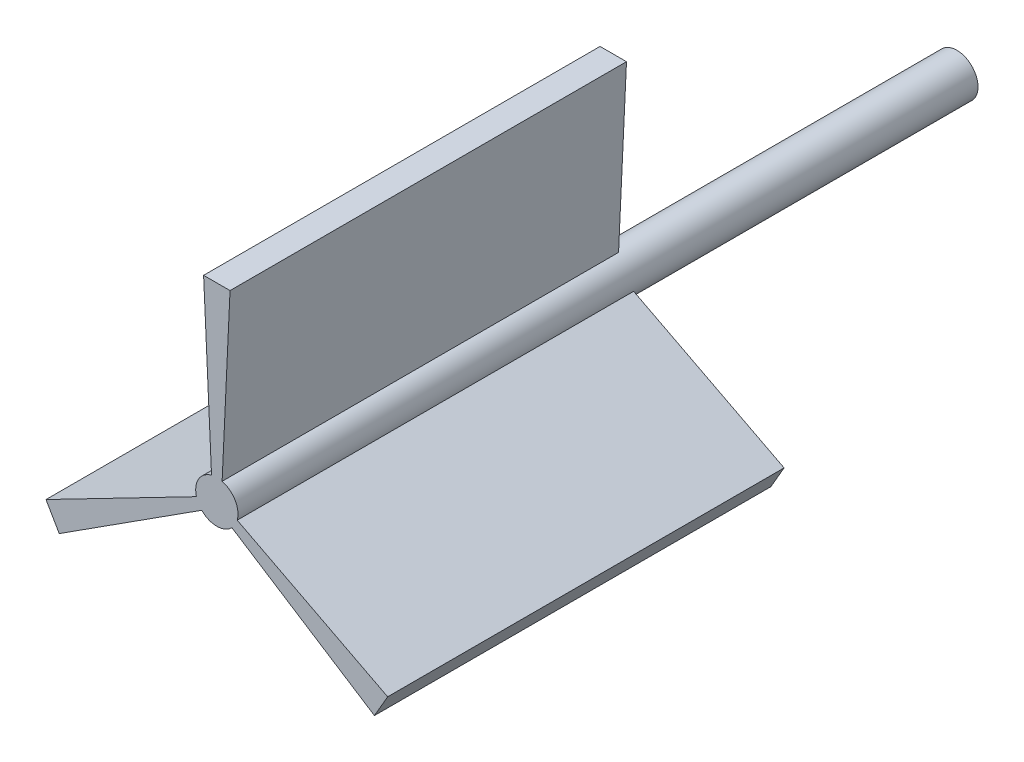
ISO-10303-21;
HEADER;
FILE_DESCRIPTION(('STEP AP214'),'2;1');
FILE_NAME('part.step','',(''),(''),'','','');
FILE_SCHEMA(('AUTOMOTIVE_DESIGN { 1 0 10303 214 1 1 1 1 }'));
ENDSEC;
DATA;
#1=APPLICATION_CONTEXT('core data for automotive mechanical design processes');
#2=APPLICATION_PROTOCOL_DEFINITION('international standard','automotive_design',2000,#1);
#3=PRODUCT_CONTEXT('',#1,'mechanical');
#4=PRODUCT('Part','Part','',(#3));
#5=PRODUCT_RELATED_PRODUCT_CATEGORY('part','',(#4));
#6=PRODUCT_DEFINITION_FORMATION('','',#4);
#7=PRODUCT_DEFINITION_CONTEXT('part definition',#1,'design');
#8=PRODUCT_DEFINITION('design','',#6,#7);
#9=PRODUCT_DEFINITION_SHAPE('','',#8);
#10=(LENGTH_UNIT() NAMED_UNIT(*) SI_UNIT(.MILLI.,.METRE.));
#11=(NAMED_UNIT(*) PLANE_ANGLE_UNIT() SI_UNIT($,.RADIAN.));
#12=(NAMED_UNIT(*) SI_UNIT($,.STERADIAN.) SOLID_ANGLE_UNIT());
#13=UNCERTAINTY_MEASURE_WITH_UNIT(LENGTH_MEASURE(1.E-05),#10,'distance_accuracy_value','');
#14=(GEOMETRIC_REPRESENTATION_CONTEXT(3) GLOBAL_UNCERTAINTY_ASSIGNED_CONTEXT((#13)) GLOBAL_UNIT_ASSIGNED_CONTEXT((#10,
#11,#12)) REPRESENTATION_CONTEXT('',''));
#15=CARTESIAN_POINT('',(0.,0.,0.));
#16=DIRECTION('',(0.,0.,1.));
#17=DIRECTION('',(1.,0.,0.));
#18=AXIS2_PLACEMENT_3D('',#15,#16,#17);
#19=CARTESIAN_POINT('',(0.,0.,140.));
#20=DIRECTION('',(0.,0.,-1.));
#21=DIRECTION('',(-1.,0.,0.));
#22=AXIS2_PLACEMENT_3D('',#19,#20,#21);
#23=CYLINDRICAL_SURFACE('',#22,4.);
#24=CARTESIAN_POINT('',(0.,0.,65.));
#25=DIRECTION('',(0.,0.,1.));
#26=DIRECTION('',(1.,0.,0.));
#27=AXIS2_PLACEMENT_3D('',#24,#25,#26);
#28=CIRCLE('',#27,4.);
#29=CARTESIAN_POINT('',(-3.85410196624968,-1.07046626931927,65.));
#30=VERTEX_POINT('',#29);
#31=CARTESIAN_POINT('',(-2.85410196624968,-2.80251707688815,65.));
#32=VERTEX_POINT('',#31);
#33=EDGE_CURVE('E11',#30,#32,#28,.T.);
#34=ORIENTED_EDGE('',*,*,#33,.F.);
#35=DIRECTION('',(0.,0.,1.));
#36=VECTOR('',#35,1.);
#37=CARTESIAN_POINT('',(-3.85410196624968,-1.07046626931927,65.));
#38=LINE('',#37,#36);
#39=CARTESIAN_POINT('',(-3.85410196624968,-1.07046626931927,140.));
#40=VERTEX_POINT('',#39);
#41=EDGE_CURVE('E152',#30,#40,#38,.T.);
#42=ORIENTED_EDGE('',*,*,#41,.T.);
#43=CARTESIAN_POINT('',(0.,0.,140.));
#44=DIRECTION('',(0.,0.,1.));
#45=DIRECTION('',(1.,0.,0.));
#46=AXIS2_PLACEMENT_3D('',#43,#44,#45);
#47=CIRCLE('',#46,4.);
#48=CARTESIAN_POINT('',(-1.,3.87298334620742,140.));
#49=VERTEX_POINT('',#48);
#50=EDGE_CURVE('E207',#49,#40,#47,.T.);
#51=ORIENTED_EDGE('',*,*,#50,.F.);
#52=DIRECTION('',(0.,0.,1.));
#53=VECTOR('',#52,1.);
#54=CARTESIAN_POINT('',(-1.,3.87298334620742,65.));
#55=LINE('',#54,#53);
#56=CARTESIAN_POINT('',(-1.,3.87298334620742,65.));
#57=VERTEX_POINT('',#56);
#58=EDGE_CURVE('E201',#57,#49,#55,.T.);
#59=ORIENTED_EDGE('',*,*,#58,.F.);
#60=CARTESIAN_POINT('',(0.,0.,65.));
#61=DIRECTION('',(0.,0.,-1.));
#62=DIRECTION('',(-1.,0.,0.));
#63=AXIS2_PLACEMENT_3D('',#60,#61,#62);
#64=CIRCLE('',#63,4.);
#65=CARTESIAN_POINT('',(1.,3.87298334620742,65.));
#66=VERTEX_POINT('',#65);
#67=EDGE_CURVE('E210',#57,#66,#64,.T.);
#68=ORIENTED_EDGE('',*,*,#67,.T.);
#69=DIRECTION('',(0.,0.,1.));
#70=VECTOR('',#69,1.);
#71=CARTESIAN_POINT('',(1.,3.87298334620742,65.));
#72=LINE('',#71,#70);
#73=CARTESIAN_POINT('',(1.,3.87298334620742,140.));
#74=VERTEX_POINT('',#73);
#75=EDGE_CURVE('E197',#66,#74,#72,.T.);
#76=ORIENTED_EDGE('',*,*,#75,.T.);
#77=CARTESIAN_POINT('',(3.85410196624969,-1.07046626931927,140.));
#78=VERTEX_POINT('',#77);
#79=EDGE_CURVE('E212',#78,#74,#47,.T.);
#80=ORIENTED_EDGE('',*,*,#79,.F.);
#81=DIRECTION('',(0.,0.,1.));
#82=VECTOR('',#81,1.);
#83=CARTESIAN_POINT('',(3.85410196624968,-1.07046626931927,65.));
#84=LINE('',#83,#82);
#85=CARTESIAN_POINT('',(3.85410196624968,-1.07046626931927,65.));
#86=VERTEX_POINT('',#85);
#87=EDGE_CURVE('E177',#86,#78,#84,.T.);
#88=ORIENTED_EDGE('',*,*,#87,.F.);
#89=CARTESIAN_POINT('',(0.,0.,65.));
#90=DIRECTION('',(0.,0.,1.));
#91=DIRECTION('',(1.,0.,0.));
#92=AXIS2_PLACEMENT_3D('',#89,#90,#91);
#93=CIRCLE('',#92,4.);
#94=CARTESIAN_POINT('',(2.85410196624969,-2.80251707688815,65.));
#95=VERTEX_POINT('',#94);
#96=EDGE_CURVE('E40',#95,#86,#93,.T.);
#97=ORIENTED_EDGE('',*,*,#96,.F.);
#98=DIRECTION('',(0.,0.,1.));
#99=VECTOR('',#98,1.);
#100=CARTESIAN_POINT('',(2.85410196624969,-2.80251707688815,65.));
#101=LINE('',#100,#99);
#102=CARTESIAN_POINT('',(2.85410196624969,-2.80251707688815,140.));
#103=VERTEX_POINT('',#102);
#104=EDGE_CURVE('E174',#95,#103,#101,.T.);
#105=ORIENTED_EDGE('',*,*,#104,.T.);
#106=CARTESIAN_POINT('',(-2.85410196624968,-2.80251707688815,140.));
#107=VERTEX_POINT('',#106);
#108=EDGE_CURVE('E211',#107,#103,#47,.T.);
#109=ORIENTED_EDGE('',*,*,#108,.F.);
#110=DIRECTION('',(0.,0.,1.));
#111=VECTOR('',#110,1.);
#112=CARTESIAN_POINT('',(-2.85410196624968,-2.80251707688815,65.));
#113=LINE('',#112,#111);
#114=EDGE_CURVE('E128',#32,#107,#113,.T.);
#115=ORIENTED_EDGE('',*,*,#114,.F.);
#116=EDGE_LOOP('',(#34,#42,#51,#59,#68,#76,#80,#88,#97,#105,#109,#115));
#117=FACE_BOUND('',#116,.T.);
#118=CARTESIAN_POINT('',(0.,0.,0.));
#119=DIRECTION('',(0.,0.,1.));
#120=DIRECTION('',(1.,0.,0.));
#121=AXIS2_PLACEMENT_3D('',#118,#119,#120);
#122=CIRCLE('',#121,4.);
#123=CARTESIAN_POINT('',(4.,0.,0.));
#124=VERTEX_POINT('',#123);
#125=EDGE_CURVE('E200',#124,#124,#122,.T.);
#126=ORIENTED_EDGE('',*,*,#125,.T.);
#127=EDGE_LOOP('',(#126));
#128=FACE_BOUND('',#127,.T.);
#129=ADVANCED_FACE('F33',(#117,#128),#23,.T.);
#130=CARTESIAN_POINT('',(0.,0.,140.));
#131=DIRECTION('',(0.,0.,1.));
#132=DIRECTION('',(1.,0.,0.));
#133=AXIS2_PLACEMENT_3D('',#130,#131,#132);
#134=PLANE('',#133);
#135=ORIENTED_EDGE('',*,*,#50,.T.);
#136=DIRECTION('',(-0.888487318074489,-0.458901171954051,0.));
#137=VECTOR('',#136,1.);
#138=CARTESIAN_POINT('',(-32.3169148873517,-15.7714281636426,140.));
#139=LINE('',#138,#137);
#140=CARTESIAN_POINT('',(-32.3169148873517,-15.7714281636426,140.));
#141=VERTEX_POINT('',#140);
#142=EDGE_CURVE('E141',#40,#141,#139,.T.);
#143=ORIENTED_EDGE('',*,*,#142,.T.);
#144=DIRECTION('',(0.500000000000001,-0.866025403784438,0.));
#145=VECTOR('',#144,1.);
#146=CARTESIAN_POINT('',(-32.3169148873517,-15.7714281636426,140.));
#147=LINE('',#146,#145);
#148=CARTESIAN_POINT('',(-29.8169148873517,-20.1015551825648,140.));
#149=VERTEX_POINT('',#148);
#150=EDGE_CURVE('E147',#141,#149,#147,.T.);
#151=ORIENTED_EDGE('',*,*,#150,.T.);
#152=DIRECTION('',(0.841663731775903,0.540002002415788,0.));
#153=VECTOR('',#152,1.);
#154=CARTESIAN_POINT('',(-29.8169148873517,-20.1015551825648,140.));
#155=LINE('',#154,#153);
#156=EDGE_CURVE('E47',#149,#107,#155,.T.);
#157=ORIENTED_EDGE('',*,*,#156,.T.);
#158=ORIENTED_EDGE('',*,*,#108,.T.);
#159=DIRECTION('',(0.841663731775904,-0.540002002415787,0.));
#160=VECTOR('',#159,1.);
#161=CARTESIAN_POINT('',(29.8169148873517,-20.1015551825648,140.));
#162=LINE('',#161,#160);
#163=CARTESIAN_POINT('',(29.8169148873517,-20.1015551825648,140.));
#164=VERTEX_POINT('',#163);
#165=EDGE_CURVE('E160',#103,#164,#162,.T.);
#166=ORIENTED_EDGE('',*,*,#165,.T.);
#167=DIRECTION('',(0.5,0.866025403784439,0.));
#168=VECTOR('',#167,1.);
#169=CARTESIAN_POINT('',(29.8169148873517,-20.1015551825648,140.));
#170=LINE('',#169,#168);
#171=CARTESIAN_POINT('',(32.3169148873517,-15.7714281636426,140.));
#172=VERTEX_POINT('',#171);
#173=EDGE_CURVE('E151',#164,#172,#170,.T.);
#174=ORIENTED_EDGE('',*,*,#173,.T.);
#175=DIRECTION('',(-0.88848731807449,0.45890117195405,0.));
#176=VECTOR('',#175,1.);
#177=CARTESIAN_POINT('',(32.3169148873517,-15.7714281636426,140.));
#178=LINE('',#177,#176);
#179=EDGE_CURVE('E54',#172,#78,#178,.T.);
#180=ORIENTED_EDGE('',*,*,#179,.T.);
#181=ORIENTED_EDGE('',*,*,#79,.T.);
#182=DIRECTION('',(0.0468235862985861,0.998903174369838,0.));
#183=VECTOR('',#182,1.);
#184=CARTESIAN_POINT('',(2.5,35.8729833462074,140.));
#185=LINE('',#184,#183);
#186=CARTESIAN_POINT('',(2.5,35.8729833462074,140.));
#187=VERTEX_POINT('',#186);
#188=EDGE_CURVE('E173',#74,#187,#185,.T.);
#189=ORIENTED_EDGE('',*,*,#188,.T.);
#190=DIRECTION('',(-1.,0.,0.));
#191=VECTOR('',#190,1.);
#192=CARTESIAN_POINT('',(2.5,35.8729833462074,140.));
#193=LINE('',#192,#191);
#194=CARTESIAN_POINT('',(-2.5,35.8729833462074,140.));
#195=VERTEX_POINT('',#194);
#196=EDGE_CURVE('E193',#187,#195,#193,.T.);
#197=ORIENTED_EDGE('',*,*,#196,.T.);
#198=DIRECTION('',(0.0468235862985861,-0.998903174369838,0.));
#199=VECTOR('',#198,1.);
#200=CARTESIAN_POINT('',(-2.5,35.8729833462074,140.));
#201=LINE('',#200,#199);
#202=EDGE_CURVE('E184',#195,#49,#201,.T.);
#203=ORIENTED_EDGE('',*,*,#202,.T.);
#204=EDGE_LOOP('',(#135,#143,#151,#157,#158,#166,#174,#180,#181,#189,#197,#203));
#205=FACE_BOUND('',#204,.T.);
#206=ADVANCED_FACE('F231',(#205),#134,.T.);
#207=CARTESIAN_POINT('',(0.,0.,0.));
#208=DIRECTION('',(0.,0.,1.));
#209=DIRECTION('',(1.,0.,0.));
#210=AXIS2_PLACEMENT_3D('',#207,#208,#209);
#211=PLANE('',#210);
#212=ORIENTED_EDGE('',*,*,#125,.F.);
#213=EDGE_LOOP('',(#212));
#214=FACE_BOUND('',#213,.T.);
#215=ADVANCED_FACE('F253',(#214),#211,.F.);
#216=CARTESIAN_POINT('',(2.5,35.8729833462074,65.));
#217=DIRECTION('',(0.998903174369838,-0.0468235862985861,0.));
#218=DIRECTION('',(0.0468235862985862,0.998903174369838,0.));
#219=AXIS2_PLACEMENT_3D('',#216,#217,#218);
#220=PLANE('',#219);
#221=ORIENTED_EDGE('',*,*,#188,.F.);
#222=ORIENTED_EDGE('',*,*,#75,.F.);
#223=DIRECTION('',(0.0468235862985861,0.998903174369838,0.));
#224=VECTOR('',#223,1.);
#225=CARTESIAN_POINT('',(2.5,35.8729833462074,65.));
#226=LINE('',#225,#224);
#227=CARTESIAN_POINT('',(2.5,35.8729833462074,65.));
#228=VERTEX_POINT('',#227);
#229=EDGE_CURVE('E180',#66,#228,#226,.T.);
#230=ORIENTED_EDGE('',*,*,#229,.T.);
#231=DIRECTION('',(0.,0.,1.));
#232=VECTOR('',#231,1.);
#233=CARTESIAN_POINT('',(2.5,35.8729833462074,65.));
#234=LINE('',#233,#232);
#235=EDGE_CURVE('E190',#228,#187,#234,.T.);
#236=ORIENTED_EDGE('',*,*,#235,.T.);
#237=EDGE_LOOP('',(#221,#222,#230,#236));
#238=FACE_BOUND('',#237,.T.);
#239=ADVANCED_FACE('F258',(#238),#220,.T.);
#240=CARTESIAN_POINT('',(-2.5,35.8729833462074,65.));
#241=DIRECTION('',(-0.998903174369838,-0.0468235862985861,0.));
#242=DIRECTION('',(0.0468235862985862,-0.998903174369838,0.));
#243=AXIS2_PLACEMENT_3D('',#240,#241,#242);
#244=PLANE('',#243);
#245=ORIENTED_EDGE('',*,*,#202,.F.);
#246=DIRECTION('',(0.,0.,1.));
#247=VECTOR('',#246,1.);
#248=CARTESIAN_POINT('',(-2.5,35.8729833462074,65.));
#249=LINE('',#248,#247);
#250=CARTESIAN_POINT('',(-2.5,35.8729833462074,65.));
#251=VERTEX_POINT('',#250);
#252=EDGE_CURVE('E204',#251,#195,#249,.T.);
#253=ORIENTED_EDGE('',*,*,#252,.F.);
#254=DIRECTION('',(0.0468235862985861,-0.998903174369838,0.));
#255=VECTOR('',#254,1.);
#256=CARTESIAN_POINT('',(-2.5,35.8729833462074,65.));
#257=LINE('',#256,#255);
#258=EDGE_CURVE('E187',#251,#57,#257,.T.);
#259=ORIENTED_EDGE('',*,*,#258,.T.);
#260=ORIENTED_EDGE('',*,*,#58,.T.);
#261=EDGE_LOOP('',(#245,#253,#259,#260));
#262=FACE_BOUND('',#261,.T.);
#263=ADVANCED_FACE('F263',(#262),#244,.T.);
#264=CARTESIAN_POINT('',(2.5,35.8729833462074,65.));
#265=DIRECTION('',(0.,1.,0.));
#266=DIRECTION('',(0.,0.,1.));
#267=AXIS2_PLACEMENT_3D('',#264,#265,#266);
#268=PLANE('',#267);
#269=ORIENTED_EDGE('',*,*,#196,.F.);
#270=ORIENTED_EDGE('',*,*,#235,.F.);
#271=DIRECTION('',(-1.,0.,0.));
#272=VECTOR('',#271,1.);
#273=CARTESIAN_POINT('',(2.5,35.8729833462074,65.));
#274=LINE('',#273,#272);
#275=EDGE_CURVE('E183',#228,#251,#274,.T.);
#276=ORIENTED_EDGE('',*,*,#275,.T.);
#277=ORIENTED_EDGE('',*,*,#252,.T.);
#278=EDGE_LOOP('',(#269,#270,#276,#277));
#279=FACE_BOUND('',#278,.T.);
#280=ADVANCED_FACE('F245',(#279),#268,.T.);
#281=CARTESIAN_POINT('',(0.,0.,65.));
#282=DIRECTION('',(0.,0.,-1.));
#283=DIRECTION('',(-1.,0.,0.));
#284=AXIS2_PLACEMENT_3D('',#281,#282,#283);
#285=PLANE('',#284);
#286=ORIENTED_EDGE('',*,*,#67,.F.);
#287=ORIENTED_EDGE('',*,*,#258,.F.);
#288=ORIENTED_EDGE('',*,*,#275,.F.);
#289=ORIENTED_EDGE('',*,*,#229,.F.);
#290=EDGE_LOOP('',(#286,#287,#288,#289));
#291=FACE_BOUND('',#290,.T.);
#292=ADVANCED_FACE('F238',(#291),#285,.T.);
#293=CARTESIAN_POINT('',(29.8169148873517,-20.1015551825648,65.));
#294=DIRECTION('',(0.866025403784439,-0.5,0.));
#295=DIRECTION('',(0.5,0.866025403784439,0.));
#296=AXIS2_PLACEMENT_3D('',#293,#294,#295);
#297=PLANE('',#296);
#298=ORIENTED_EDGE('',*,*,#173,.F.);
#299=DIRECTION('',(0.,0.,1.));
#300=VECTOR('',#299,1.);
#301=CARTESIAN_POINT('',(29.8169148873517,-20.1015551825648,65.));
#302=LINE('',#301,#300);
#303=CARTESIAN_POINT('',(29.8169148873517,-20.1015551825648,65.));
#304=VERTEX_POINT('',#303);
#305=EDGE_CURVE('E171',#304,#164,#302,.T.);
#306=ORIENTED_EDGE('',*,*,#305,.F.);
#307=DIRECTION('',(0.5,0.866025403784439,0.));
#308=VECTOR('',#307,1.);
#309=CARTESIAN_POINT('',(29.8169148873517,-20.1015551825648,65.));
#310=LINE('',#309,#308);
#311=CARTESIAN_POINT('',(32.3169148873517,-15.7714281636426,65.));
#312=VERTEX_POINT('',#311);
#313=EDGE_CURVE('E156',#304,#312,#310,.T.);
#314=ORIENTED_EDGE('',*,*,#313,.T.);
#315=DIRECTION('',(0.,0.,1.));
#316=VECTOR('',#315,1.);
#317=CARTESIAN_POINT('',(32.3169148873517,-15.7714281636426,65.));
#318=LINE('',#317,#316);
#319=EDGE_CURVE('E166',#312,#172,#318,.T.);
#320=ORIENTED_EDGE('',*,*,#319,.T.);
#321=EDGE_LOOP('',(#298,#306,#314,#320));
#322=FACE_BOUND('',#321,.T.);
#323=ADVANCED_FACE('F236',(#322),#297,.T.);
#324=CARTESIAN_POINT('',(29.8169148873517,-20.1015551825648,65.));
#325=DIRECTION('',(-0.540002002415787,-0.841663731775903,0.));
#326=DIRECTION('',(0.841663731775903,-0.540002002415787,0.));
#327=AXIS2_PLACEMENT_3D('',#324,#325,#326);
#328=PLANE('',#327);
#329=ORIENTED_EDGE('',*,*,#165,.F.);
#330=ORIENTED_EDGE('',*,*,#104,.F.);
#331=DIRECTION('',(0.841663731775904,-0.540002002415787,0.));
#332=VECTOR('',#331,1.);
#333=CARTESIAN_POINT('',(29.8169148873517,-20.1015551825648,65.));
#334=LINE('',#333,#332);
#335=EDGE_CURVE('E163',#95,#304,#334,.T.);
#336=ORIENTED_EDGE('',*,*,#335,.T.);
#337=ORIENTED_EDGE('',*,*,#305,.T.);
#338=EDGE_LOOP('',(#329,#330,#336,#337));
#339=FACE_BOUND('',#338,.T.);
#340=ADVANCED_FACE('F233',(#339),#328,.T.);
#341=CARTESIAN_POINT('',(32.3169148873517,-15.7714281636426,65.));
#342=DIRECTION('',(0.45890117195405,0.88848731807449,0.));
#343=DIRECTION('',(-0.88848731807449,0.45890117195405,0.));
#344=AXIS2_PLACEMENT_3D('',#341,#342,#343);
#345=PLANE('',#344);
#346=ORIENTED_EDGE('',*,*,#179,.F.);
#347=ORIENTED_EDGE('',*,*,#319,.F.);
#348=DIRECTION('',(-0.88848731807449,0.45890117195405,0.));
#349=VECTOR('',#348,1.);
#350=CARTESIAN_POINT('',(32.3169148873517,-15.7714281636426,65.));
#351=LINE('',#350,#349);
#352=EDGE_CURVE('E159',#312,#86,#351,.T.);
#353=ORIENTED_EDGE('',*,*,#352,.T.);
#354=ORIENTED_EDGE('',*,*,#87,.T.);
#355=EDGE_LOOP('',(#346,#347,#353,#354));
#356=FACE_BOUND('',#355,.T.);
#357=ADVANCED_FACE('F225',(#356),#345,.T.);
#358=CARTESIAN_POINT('',(0.,0.,65.));
#359=DIRECTION('',(0.,0.,1.));
#360=DIRECTION('',(1.,0.,0.));
#361=AXIS2_PLACEMENT_3D('',#358,#359,#360);
#362=PLANE('',#361);
#363=ORIENTED_EDGE('',*,*,#335,.F.);
#364=ORIENTED_EDGE('',*,*,#96,.T.);
#365=ORIENTED_EDGE('',*,*,#352,.F.);
#366=ORIENTED_EDGE('',*,*,#313,.F.);
#367=EDGE_LOOP('',(#363,#364,#365,#366));
#368=FACE_BOUND('',#367,.T.);
#369=ADVANCED_FACE('F220',(#368),#362,.F.);
#370=CARTESIAN_POINT('',(-32.3169148873517,-15.7714281636426,65.));
#371=DIRECTION('',(-0.866025403784438,-0.500000000000002,0.));
#372=DIRECTION('',(0.500000000000002,-0.866025403784438,0.));
#373=AXIS2_PLACEMENT_3D('',#370,#371,#372);
#374=PLANE('',#373);
#375=ORIENTED_EDGE('',*,*,#150,.F.);
#376=DIRECTION('',(0.,0.,1.));
#377=VECTOR('',#376,1.);
#378=CARTESIAN_POINT('',(-32.3169148873517,-15.7714281636426,65.));
#379=LINE('',#378,#377);
#380=CARTESIAN_POINT('',(-32.3169148873517,-15.7714281636426,65.));
#381=VERTEX_POINT('',#380);
#382=EDGE_CURVE('E140',#381,#141,#379,.T.);
#383=ORIENTED_EDGE('',*,*,#382,.F.);
#384=DIRECTION('',(0.500000000000001,-0.866025403784438,0.));
#385=VECTOR('',#384,1.);
#386=CARTESIAN_POINT('',(-32.3169148873517,-15.7714281636426,65.));
#387=LINE('',#386,#385);
#388=CARTESIAN_POINT('',(-29.8169148873517,-20.1015551825648,65.));
#389=VERTEX_POINT('',#388);
#390=EDGE_CURVE('E135',#381,#389,#387,.T.);
#391=ORIENTED_EDGE('',*,*,#390,.T.);
#392=DIRECTION('',(0.,0.,1.));
#393=VECTOR('',#392,1.);
#394=CARTESIAN_POINT('',(-29.8169148873517,-20.1015551825648,65.));
#395=LINE('',#394,#393);
#396=EDGE_CURVE('E120',#389,#149,#395,.T.);
#397=ORIENTED_EDGE('',*,*,#396,.T.);
#398=EDGE_LOOP('',(#375,#383,#391,#397));
#399=FACE_BOUND('',#398,.T.);
#400=ADVANCED_FACE('F139',(#399),#374,.T.);
#401=CARTESIAN_POINT('',(-32.3169148873517,-15.7714281636426,65.));
#402=DIRECTION('',(-0.458901171954051,0.888487318074489,0.));
#403=DIRECTION('',(-0.888487318074489,-0.458901171954051,0.));
#404=AXIS2_PLACEMENT_3D('',#401,#402,#403);
#405=PLANE('',#404);
#406=ORIENTED_EDGE('',*,*,#142,.F.);
#407=ORIENTED_EDGE('',*,*,#41,.F.);
#408=DIRECTION('',(-0.888487318074489,-0.458901171954051,0.));
#409=VECTOR('',#408,1.);
#410=CARTESIAN_POINT('',(-32.3169148873517,-15.7714281636426,65.));
#411=LINE('',#410,#409);
#412=EDGE_CURVE('E129',#30,#381,#411,.T.);
#413=ORIENTED_EDGE('',*,*,#412,.T.);
#414=ORIENTED_EDGE('',*,*,#382,.T.);
#415=EDGE_LOOP('',(#406,#407,#413,#414));
#416=FACE_BOUND('',#415,.T.);
#417=ADVANCED_FACE('F280',(#416),#405,.T.);
#418=CARTESIAN_POINT('',(-29.8169148873517,-20.1015551825648,65.));
#419=DIRECTION('',(0.540002002415788,-0.841663731775903,0.));
#420=DIRECTION('',(0.841663731775903,0.540002002415788,0.));
#421=AXIS2_PLACEMENT_3D('',#418,#419,#420);
#422=PLANE('',#421);
#423=ORIENTED_EDGE('',*,*,#156,.F.);
#424=ORIENTED_EDGE('',*,*,#396,.F.);
#425=DIRECTION('',(0.841663731775903,0.540002002415788,0.));
#426=VECTOR('',#425,1.);
#427=CARTESIAN_POINT('',(-29.8169148873517,-20.1015551825648,65.));
#428=LINE('',#427,#426);
#429=EDGE_CURVE('E123',#389,#32,#428,.T.);
#430=ORIENTED_EDGE('',*,*,#429,.T.);
#431=ORIENTED_EDGE('',*,*,#114,.T.);
#432=EDGE_LOOP('',(#423,#424,#430,#431));
#433=FACE_BOUND('',#432,.T.);
#434=ADVANCED_FACE('F122',(#433),#422,.T.);
#435=CARTESIAN_POINT('',(0.,0.,65.));
#436=DIRECTION('',(0.,0.,1.));
#437=DIRECTION('',(1.,0.,0.));
#438=AXIS2_PLACEMENT_3D('',#435,#436,#437);
#439=PLANE('',#438);
#440=ORIENTED_EDGE('',*,*,#412,.F.);
#441=ORIENTED_EDGE('',*,*,#33,.T.);
#442=ORIENTED_EDGE('',*,*,#429,.F.);
#443=ORIENTED_EDGE('',*,*,#390,.F.);
#444=EDGE_LOOP('',(#440,#441,#442,#443));
#445=FACE_BOUND('',#444,.T.);
#446=ADVANCED_FACE('F134',(#445),#439,.F.);
#447=CLOSED_SHELL('',(#129,#206,#215,#239,#263,#280,#292,#323,#340,#357,#369,#400,#417,#434,#446));
#448=MANIFOLD_SOLID_BREP('B2',#447);
#449=ADVANCED_BREP_SHAPE_REPRESENTATION('',(#18,#448),#14);
#450=SHAPE_DEFINITION_REPRESENTATION(#9,#449);
ENDSEC;
END-ISO-10303-21;
